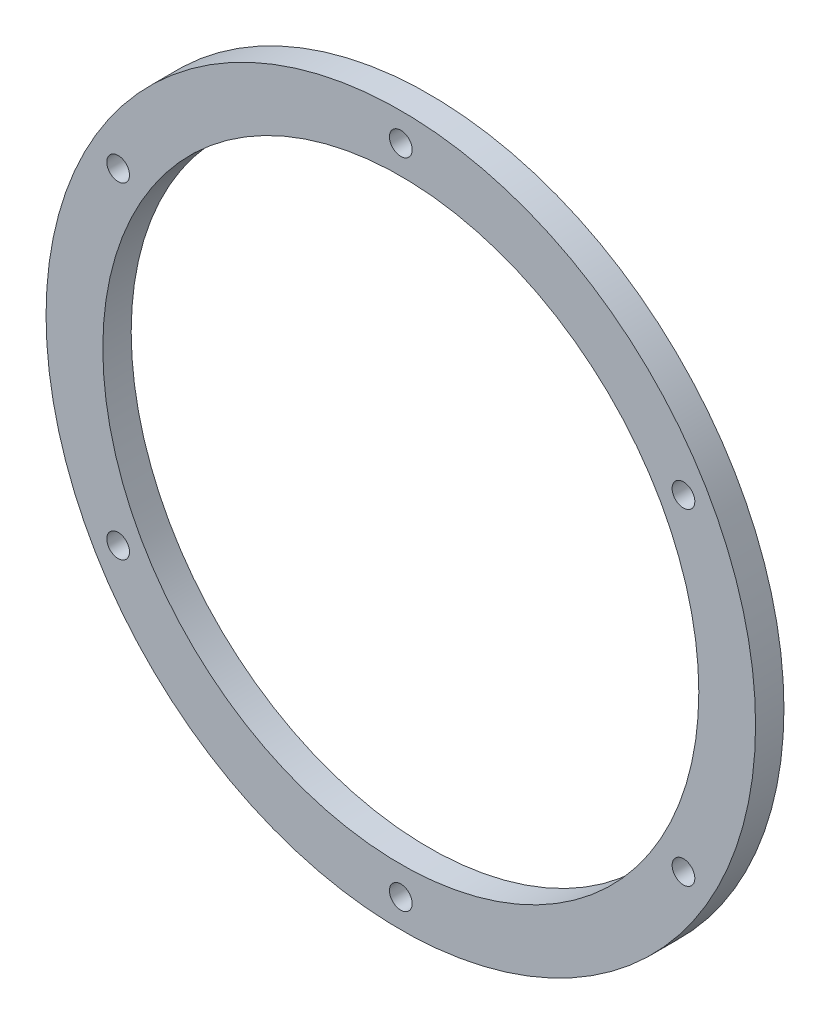
ISO-10303-21;
HEADER;
FILE_DESCRIPTION(('STEP AP214'),'2;1');
FILE_NAME('part.step','',(''),(''),'','','');
FILE_SCHEMA(('AUTOMOTIVE_DESIGN { 1 0 10303 214 1 1 1 1 }'));
ENDSEC;
DATA;
#1=APPLICATION_CONTEXT('core data for automotive mechanical design processes');
#2=APPLICATION_PROTOCOL_DEFINITION('international standard','automotive_design',2000,#1);
#3=PRODUCT_CONTEXT('',#1,'mechanical');
#4=PRODUCT('Part','Part','',(#3));
#5=PRODUCT_RELATED_PRODUCT_CATEGORY('part','',(#4));
#6=PRODUCT_DEFINITION_FORMATION('','',#4);
#7=PRODUCT_DEFINITION_CONTEXT('part definition',#1,'design');
#8=PRODUCT_DEFINITION('design','',#6,#7);
#9=PRODUCT_DEFINITION_SHAPE('','',#8);
#10=(LENGTH_UNIT() NAMED_UNIT(*) SI_UNIT(.MILLI.,.METRE.));
#11=(NAMED_UNIT(*) PLANE_ANGLE_UNIT() SI_UNIT($,.RADIAN.));
#12=(NAMED_UNIT(*) SI_UNIT($,.STERADIAN.) SOLID_ANGLE_UNIT());
#13=UNCERTAINTY_MEASURE_WITH_UNIT(LENGTH_MEASURE(1.E-05),#10,'distance_accuracy_value','');
#14=(GEOMETRIC_REPRESENTATION_CONTEXT(3) GLOBAL_UNCERTAINTY_ASSIGNED_CONTEXT((#13)) GLOBAL_UNIT_ASSIGNED_CONTEXT((#10,
#11,#12)) REPRESENTATION_CONTEXT('',''));
#15=CARTESIAN_POINT('',(0.,0.,0.));
#16=DIRECTION('',(0.,0.,1.));
#17=DIRECTION('',(1.,0.,0.));
#18=AXIS2_PLACEMENT_3D('',#15,#16,#17);
#19=CARTESIAN_POINT('',(0.,0.,5.));
#20=DIRECTION('',(0.,0.,1.));
#21=DIRECTION('',(1.,0.,0.));
#22=AXIS2_PLACEMENT_3D('',#19,#20,#21);
#23=PLANE('',#22);
#24=CARTESIAN_POINT('',(-99.5929214352098,57.5000000000012,5.));
#25=DIRECTION('',(0.,0.,1.));
#26=DIRECTION('',(0.50000000000001,0.866025403784433,0.));
#27=AXIS2_PLACEMENT_3D('',#24,#25,#26);
#28=CIRCLE('',#27,4.);
#29=CARTESIAN_POINT('',(-97.5929214352097,60.9641016151389,5.));
#30=VERTEX_POINT('',#29);
#31=EDGE_CURVE('E70',#30,#30,#28,.T.);
#32=ORIENTED_EDGE('',*,*,#31,.F.);
#33=EDGE_LOOP('',(#32));
#34=FACE_BOUND('',#33,.T.);
#35=CARTESIAN_POINT('',(-99.592921435211,-57.4999999999991,5.));
#36=DIRECTION('',(0.,0.,1.));
#37=DIRECTION('',(-0.499999999999992,0.866025403784443,0.));
#38=AXIS2_PLACEMENT_3D('',#35,#36,#37);
#39=CIRCLE('',#38,4.);
#40=CARTESIAN_POINT('',(-101.592921435211,-54.0358983848613,5.));
#41=VERTEX_POINT('',#40);
#42=EDGE_CURVE('E76',#41,#41,#39,.T.);
#43=ORIENTED_EDGE('',*,*,#42,.F.);
#44=EDGE_LOOP('',(#43));
#45=FACE_BOUND('',#44,.T.);
#46=CARTESIAN_POINT('',(0.,-115.,5.));
#47=DIRECTION('',(0.,0.,1.));
#48=DIRECTION('',(-1.,0.,0.));
#49=AXIS2_PLACEMENT_3D('',#46,#47,#48);
#50=CIRCLE('',#49,4.);
#51=CARTESIAN_POINT('',(-4.,-115.,5.));
#52=VERTEX_POINT('',#51);
#53=EDGE_CURVE('E82',#52,#52,#50,.T.);
#54=ORIENTED_EDGE('',*,*,#53,.F.);
#55=EDGE_LOOP('',(#54));
#56=FACE_BOUND('',#55,.T.);
#57=CARTESIAN_POINT('',(99.5929214352102,-57.5000000000005,5.));
#58=DIRECTION('',(0.,0.,1.));
#59=DIRECTION('',(-0.500000000000004,-0.866025403784436,0.));
#60=AXIS2_PLACEMENT_3D('',#57,#58,#59);
#61=CIRCLE('',#60,4.);
#62=CARTESIAN_POINT('',(97.5929214352102,-60.9641016151382,5.));
#63=VERTEX_POINT('',#62);
#64=EDGE_CURVE('E88',#63,#63,#61,.T.);
#65=ORIENTED_EDGE('',*,*,#64,.F.);
#66=EDGE_LOOP('',(#65));
#67=FACE_BOUND('',#66,.T.);
#68=CARTESIAN_POINT('',(99.5929214352106,57.4999999999998,5.));
#69=DIRECTION('',(0.,0.,1.));
#70=DIRECTION('',(0.499999999999998,-0.86602540378444,0.));
#71=AXIS2_PLACEMENT_3D('',#68,#69,#70);
#72=CIRCLE('',#71,4.);
#73=CARTESIAN_POINT('',(101.592921435211,54.035898384862,5.));
#74=VERTEX_POINT('',#73);
#75=EDGE_CURVE('E64',#74,#74,#72,.T.);
#76=ORIENTED_EDGE('',*,*,#75,.F.);
#77=EDGE_LOOP('',(#76));
#78=FACE_BOUND('',#77,.T.);
#79=CARTESIAN_POINT('',(0.,115.,5.));
#80=DIRECTION('',(0.,0.,1.));
#81=DIRECTION('',(1.,0.,0.));
#82=AXIS2_PLACEMENT_3D('',#79,#80,#81);
#83=CIRCLE('',#82,4.);
#84=CARTESIAN_POINT('',(4.,115.,5.));
#85=VERTEX_POINT('',#84);
#86=EDGE_CURVE('E58',#85,#85,#83,.T.);
#87=ORIENTED_EDGE('',*,*,#86,.F.);
#88=EDGE_LOOP('',(#87));
#89=FACE_BOUND('',#88,.T.);
#90=CARTESIAN_POINT('',(0.,0.,5.));
#91=DIRECTION('',(0.,0.,1.));
#92=DIRECTION('',(1.,0.,0.));
#93=AXIS2_PLACEMENT_3D('',#90,#91,#92);
#94=CIRCLE('',#93,125.);
#95=CARTESIAN_POINT('',(125.,0.,5.));
#96=VERTEX_POINT('',#95);
#97=EDGE_CURVE('E10',#96,#96,#94,.T.);
#98=ORIENTED_EDGE('',*,*,#97,.T.);
#99=EDGE_LOOP('',(#98));
#100=FACE_BOUND('',#99,.T.);
#101=CARTESIAN_POINT('',(0.,0.,5.));
#102=DIRECTION('',(0.,0.,1.));
#103=DIRECTION('',(1.,0.,0.));
#104=AXIS2_PLACEMENT_3D('',#101,#102,#103);
#105=CIRCLE('',#104,105.);
#106=CARTESIAN_POINT('',(105.,0.,5.));
#107=VERTEX_POINT('',#106);
#108=EDGE_CURVE('E50',#107,#107,#105,.T.);
#109=ORIENTED_EDGE('',*,*,#108,.F.);
#110=EDGE_LOOP('',(#109));
#111=FACE_BOUND('',#110,.T.);
#112=ADVANCED_FACE('F39',(#34,#45,#56,#67,#78,#89,#100,#111),#23,.T.);
#113=CARTESIAN_POINT('',(0.,0.,-5.));
#114=DIRECTION('',(0.,0.,1.));
#115=DIRECTION('',(1.,0.,0.));
#116=AXIS2_PLACEMENT_3D('',#113,#114,#115);
#117=PLANE('',#116);
#118=CARTESIAN_POINT('',(-99.5929214352098,57.5000000000012,-5.));
#119=DIRECTION('',(0.,0.,1.));
#120=DIRECTION('',(0.50000000000001,0.866025403784433,0.));
#121=AXIS2_PLACEMENT_3D('',#118,#119,#120);
#122=CIRCLE('',#121,4.);
#123=CARTESIAN_POINT('',(-97.5929214352097,60.9641016151389,-5.));
#124=VERTEX_POINT('',#123);
#125=EDGE_CURVE('E73',#124,#124,#122,.T.);
#126=ORIENTED_EDGE('',*,*,#125,.T.);
#127=EDGE_LOOP('',(#126));
#128=FACE_BOUND('',#127,.T.);
#129=CARTESIAN_POINT('',(-99.592921435211,-57.4999999999991,-5.));
#130=DIRECTION('',(0.,0.,1.));
#131=DIRECTION('',(-0.499999999999992,0.866025403784443,0.));
#132=AXIS2_PLACEMENT_3D('',#129,#130,#131);
#133=CIRCLE('',#132,4.);
#134=CARTESIAN_POINT('',(-101.592921435211,-54.0358983848613,-5.));
#135=VERTEX_POINT('',#134);
#136=EDGE_CURVE('E79',#135,#135,#133,.T.);
#137=ORIENTED_EDGE('',*,*,#136,.T.);
#138=EDGE_LOOP('',(#137));
#139=FACE_BOUND('',#138,.T.);
#140=CARTESIAN_POINT('',(0.,-115.,-5.));
#141=DIRECTION('',(0.,0.,1.));
#142=DIRECTION('',(-1.,0.,0.));
#143=AXIS2_PLACEMENT_3D('',#140,#141,#142);
#144=CIRCLE('',#143,4.);
#145=CARTESIAN_POINT('',(-4.,-115.,-5.));
#146=VERTEX_POINT('',#145);
#147=EDGE_CURVE('E85',#146,#146,#144,.T.);
#148=ORIENTED_EDGE('',*,*,#147,.T.);
#149=EDGE_LOOP('',(#148));
#150=FACE_BOUND('',#149,.T.);
#151=CARTESIAN_POINT('',(99.5929214352102,-57.5000000000005,-5.));
#152=DIRECTION('',(0.,0.,1.));
#153=DIRECTION('',(-0.500000000000004,-0.866025403784436,0.));
#154=AXIS2_PLACEMENT_3D('',#151,#152,#153);
#155=CIRCLE('',#154,4.);
#156=CARTESIAN_POINT('',(97.5929214352102,-60.9641016151382,-5.));
#157=VERTEX_POINT('',#156);
#158=EDGE_CURVE('E67',#157,#157,#155,.T.);
#159=ORIENTED_EDGE('',*,*,#158,.T.);
#160=EDGE_LOOP('',(#159));
#161=FACE_BOUND('',#160,.T.);
#162=CARTESIAN_POINT('',(99.5929214352106,57.4999999999998,-5.));
#163=DIRECTION('',(0.,0.,1.));
#164=DIRECTION('',(0.499999999999998,-0.86602540378444,0.));
#165=AXIS2_PLACEMENT_3D('',#162,#163,#164);
#166=CIRCLE('',#165,4.);
#167=CARTESIAN_POINT('',(101.592921435211,54.035898384862,-5.));
#168=VERTEX_POINT('',#167);
#169=EDGE_CURVE('E61',#168,#168,#166,.T.);
#170=ORIENTED_EDGE('',*,*,#169,.T.);
#171=EDGE_LOOP('',(#170));
#172=FACE_BOUND('',#171,.T.);
#173=CARTESIAN_POINT('',(0.,115.,-5.));
#174=DIRECTION('',(0.,0.,1.));
#175=DIRECTION('',(1.,0.,0.));
#176=AXIS2_PLACEMENT_3D('',#173,#174,#175);
#177=CIRCLE('',#176,4.);
#178=CARTESIAN_POINT('',(4.,115.,-5.));
#179=VERTEX_POINT('',#178);
#180=EDGE_CURVE('E55',#179,#179,#177,.T.);
#181=ORIENTED_EDGE('',*,*,#180,.T.);
#182=EDGE_LOOP('',(#181));
#183=FACE_BOUND('',#182,.T.);
#184=CARTESIAN_POINT('',(0.,0.,-5.));
#185=DIRECTION('',(0.,0.,1.));
#186=DIRECTION('',(1.,0.,0.));
#187=AXIS2_PLACEMENT_3D('',#184,#185,#186);
#188=CIRCLE('',#187,125.);
#189=CARTESIAN_POINT('',(125.,0.,-5.));
#190=VERTEX_POINT('',#189);
#191=EDGE_CURVE('E43',#190,#190,#188,.T.);
#192=ORIENTED_EDGE('',*,*,#191,.F.);
#193=EDGE_LOOP('',(#192));
#194=FACE_BOUND('',#193,.T.);
#195=CARTESIAN_POINT('',(0.,0.,-5.));
#196=DIRECTION('',(0.,0.,1.));
#197=DIRECTION('',(1.,0.,0.));
#198=AXIS2_PLACEMENT_3D('',#195,#196,#197);
#199=CIRCLE('',#198,105.);
#200=CARTESIAN_POINT('',(105.,0.,-5.));
#201=VERTEX_POINT('',#200);
#202=EDGE_CURVE('E52',#201,#201,#199,.T.);
#203=ORIENTED_EDGE('',*,*,#202,.T.);
#204=EDGE_LOOP('',(#203));
#205=FACE_BOUND('',#204,.T.);
#206=ADVANCED_FACE('F94',(#128,#139,#150,#161,#172,#183,#194,#205),#117,.F.);
#207=CARTESIAN_POINT('',(0.,0.,5.));
#208=DIRECTION('',(0.,0.,-1.));
#209=DIRECTION('',(-1.,0.,0.));
#210=AXIS2_PLACEMENT_3D('',#207,#208,#209);
#211=CYLINDRICAL_SURFACE('',#210,125.);
#212=ORIENTED_EDGE('',*,*,#97,.F.);
#213=EDGE_LOOP('',(#212));
#214=FACE_BOUND('',#213,.T.);
#215=ORIENTED_EDGE('',*,*,#191,.T.);
#216=EDGE_LOOP('',(#215));
#217=FACE_BOUND('',#216,.T.);
#218=ADVANCED_FACE('F41',(#214,#217),#211,.T.);
#219=CARTESIAN_POINT('',(0.,0.,5.));
#220=DIRECTION('',(0.,0.,-1.));
#221=DIRECTION('',(-1.,0.,0.));
#222=AXIS2_PLACEMENT_3D('',#219,#220,#221);
#223=CYLINDRICAL_SURFACE('',#222,105.);
#224=ORIENTED_EDGE('',*,*,#108,.T.);
#225=EDGE_LOOP('',(#224));
#226=FACE_BOUND('',#225,.T.);
#227=ORIENTED_EDGE('',*,*,#202,.F.);
#228=EDGE_LOOP('',(#227));
#229=FACE_BOUND('',#228,.T.);
#230=ADVANCED_FACE('F115',(#226,#229),#223,.F.);
#231=CARTESIAN_POINT('',(0.,115.,-5.));
#232=DIRECTION('',(0.,0.,1.));
#233=DIRECTION('',(1.,0.,0.));
#234=AXIS2_PLACEMENT_3D('',#231,#232,#233);
#235=CYLINDRICAL_SURFACE('',#234,4.);
#236=ORIENTED_EDGE('',*,*,#180,.F.);
#237=EDGE_LOOP('',(#236));
#238=FACE_BOUND('',#237,.T.);
#239=ORIENTED_EDGE('',*,*,#86,.T.);
#240=EDGE_LOOP('',(#239));
#241=FACE_BOUND('',#240,.T.);
#242=ADVANCED_FACE('F118',(#238,#241),#235,.F.);
#243=CARTESIAN_POINT('',(99.5929214352106,57.4999999999998,-5.));
#244=DIRECTION('',(0.,0.,1.));
#245=DIRECTION('',(1.,0.,0.));
#246=AXIS2_PLACEMENT_3D('',#243,#244,#245);
#247=CYLINDRICAL_SURFACE('',#246,4.);
#248=ORIENTED_EDGE('',*,*,#169,.F.);
#249=EDGE_LOOP('',(#248));
#250=FACE_BOUND('',#249,.T.);
#251=ORIENTED_EDGE('',*,*,#75,.T.);
#252=EDGE_LOOP('',(#251));
#253=FACE_BOUND('',#252,.T.);
#254=ADVANCED_FACE('F101',(#250,#253),#247,.F.);
#255=CARTESIAN_POINT('',(99.5929214352102,-57.5000000000005,-5.));
#256=DIRECTION('',(0.,0.,1.));
#257=DIRECTION('',(1.,0.,0.));
#258=AXIS2_PLACEMENT_3D('',#255,#256,#257);
#259=CYLINDRICAL_SURFACE('',#258,4.);
#260=ORIENTED_EDGE('',*,*,#158,.F.);
#261=EDGE_LOOP('',(#260));
#262=FACE_BOUND('',#261,.T.);
#263=ORIENTED_EDGE('',*,*,#64,.T.);
#264=EDGE_LOOP('',(#263));
#265=FACE_BOUND('',#264,.T.);
#266=ADVANCED_FACE('F97',(#262,#265),#259,.F.);
#267=CARTESIAN_POINT('',(0.,-115.,-5.));
#268=DIRECTION('',(0.,0.,1.));
#269=DIRECTION('',(1.,0.,0.));
#270=AXIS2_PLACEMENT_3D('',#267,#268,#269);
#271=CYLINDRICAL_SURFACE('',#270,4.);
#272=ORIENTED_EDGE('',*,*,#147,.F.);
#273=EDGE_LOOP('',(#272));
#274=FACE_BOUND('',#273,.T.);
#275=ORIENTED_EDGE('',*,*,#53,.T.);
#276=EDGE_LOOP('',(#275));
#277=FACE_BOUND('',#276,.T.);
#278=ADVANCED_FACE('F100',(#274,#277),#271,.F.);
#279=CARTESIAN_POINT('',(-99.592921435211,-57.4999999999991,-5.));
#280=DIRECTION('',(0.,0.,1.));
#281=DIRECTION('',(1.,0.,0.));
#282=AXIS2_PLACEMENT_3D('',#279,#280,#281);
#283=CYLINDRICAL_SURFACE('',#282,4.);
#284=ORIENTED_EDGE('',*,*,#136,.F.);
#285=EDGE_LOOP('',(#284));
#286=FACE_BOUND('',#285,.T.);
#287=ORIENTED_EDGE('',*,*,#42,.T.);
#288=EDGE_LOOP('',(#287));
#289=FACE_BOUND('',#288,.T.);
#290=ADVANCED_FACE('F139',(#286,#289),#283,.F.);
#291=CARTESIAN_POINT('',(-99.5929214352098,57.5000000000012,-5.));
#292=DIRECTION('',(0.,0.,1.));
#293=DIRECTION('',(1.,0.,0.));
#294=AXIS2_PLACEMENT_3D('',#291,#292,#293);
#295=CYLINDRICAL_SURFACE('',#294,4.);
#296=ORIENTED_EDGE('',*,*,#125,.F.);
#297=EDGE_LOOP('',(#296));
#298=FACE_BOUND('',#297,.T.);
#299=ORIENTED_EDGE('',*,*,#31,.T.);
#300=EDGE_LOOP('',(#299));
#301=FACE_BOUND('',#300,.T.);
#302=ADVANCED_FACE('F136',(#298,#301),#295,.F.);
#303=CLOSED_SHELL('',(#112,#206,#218,#230,#242,#254,#266,#278,#290,#302));
#304=MANIFOLD_SOLID_BREP('B2',#303);
#305=ADVANCED_BREP_SHAPE_REPRESENTATION('',(#18,#304),#14);
#306=SHAPE_DEFINITION_REPRESENTATION(#9,#305);
ENDSEC;
END-ISO-10303-21;
